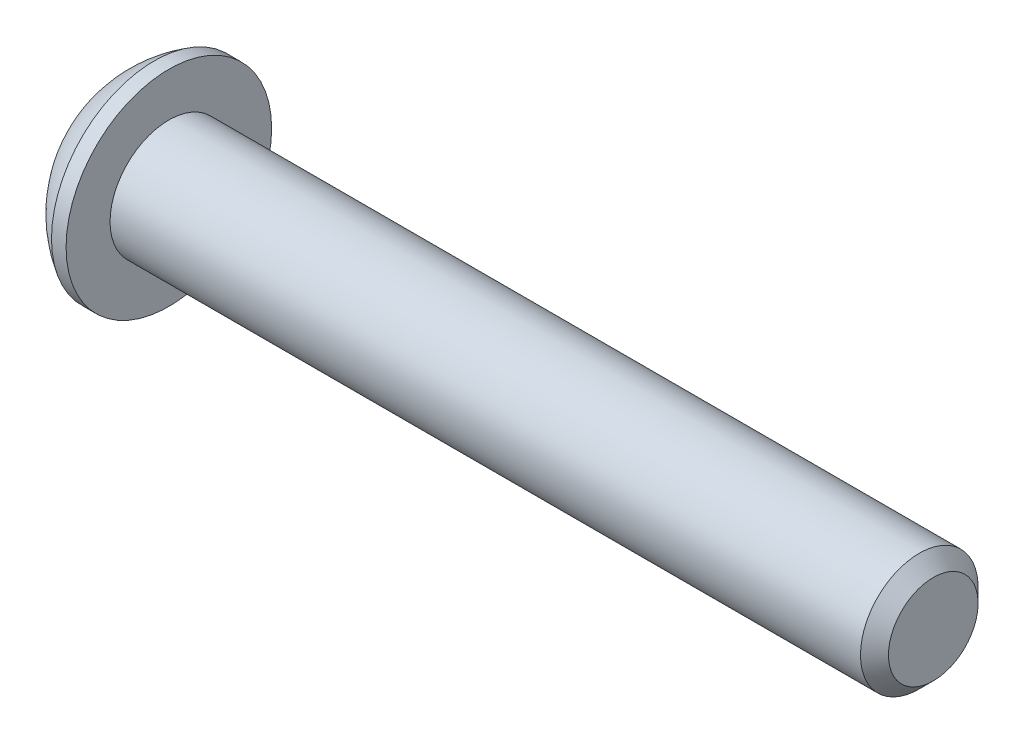
ISO-10303-21;
HEADER;
FILE_DESCRIPTION(('STEP AP214'),'2;1');
FILE_NAME('part.step','',(''),(''),'','','');
FILE_SCHEMA(('AUTOMOTIVE_DESIGN { 1 0 10303 214 1 1 1 1 }'));
ENDSEC;
DATA;
#1=APPLICATION_CONTEXT('core data for automotive mechanical design processes');
#2=APPLICATION_PROTOCOL_DEFINITION('international standard','automotive_design',2000,#1);
#3=PRODUCT_CONTEXT('',#1,'mechanical');
#4=PRODUCT('Part','Part','',(#3));
#5=PRODUCT_RELATED_PRODUCT_CATEGORY('part','',(#4));
#6=PRODUCT_DEFINITION_FORMATION('','',#4);
#7=PRODUCT_DEFINITION_CONTEXT('part definition',#1,'design');
#8=PRODUCT_DEFINITION('design','',#6,#7);
#9=PRODUCT_DEFINITION_SHAPE('','',#8);
#10=(LENGTH_UNIT() NAMED_UNIT(*) SI_UNIT(.MILLI.,.METRE.));
#11=(NAMED_UNIT(*) PLANE_ANGLE_UNIT() SI_UNIT($,.RADIAN.));
#12=(NAMED_UNIT(*) SI_UNIT($,.STERADIAN.) SOLID_ANGLE_UNIT());
#13=UNCERTAINTY_MEASURE_WITH_UNIT(LENGTH_MEASURE(1.E-05),#10,'distance_accuracy_value','');
#14=(GEOMETRIC_REPRESENTATION_CONTEXT(3) GLOBAL_UNCERTAINTY_ASSIGNED_CONTEXT((#13)) GLOBAL_UNIT_ASSIGNED_CONTEXT((#10,
#11,#12)) REPRESENTATION_CONTEXT('',''));
#15=CARTESIAN_POINT('',(0.,0.,0.));
#16=DIRECTION('',(0.,0.,1.));
#17=DIRECTION('',(1.,0.,0.));
#18=AXIS2_PLACEMENT_3D('',#15,#16,#17);
#19=CARTESIAN_POINT('',(0.,0.,0.));
#20=DIRECTION('',(-1.,0.,0.));
#21=DIRECTION('',(0.,0.,1.));
#22=AXIS2_PLACEMENT_3D('',#19,#20,#21);
#23=PLANE('',#22);
#24=CARTESIAN_POINT('',(0.,0.,0.));
#25=DIRECTION('',(-1.,0.,0.));
#26=DIRECTION('',(0.,0.,1.));
#27=AXIS2_PLACEMENT_3D('',#24,#25,#26);
#28=CIRCLE('',#27,2.77495);
#29=CARTESIAN_POINT('',(0.,0.,2.77495));
#30=VERTEX_POINT('',#29);
#31=EDGE_CURVE('E11',#30,#30,#28,.T.);
#32=ORIENTED_EDGE('',*,*,#31,.T.);
#33=EDGE_LOOP('',(#32));
#34=FACE_BOUND('',#33,.T.);
#35=DIRECTION('',(0.,-1.,0.));
#36=VECTOR('',#35,1.);
#37=CARTESIAN_POINT('',(0.,-1.14384635331849,1.9812));
#38=LINE('',#37,#36);
#39=CARTESIAN_POINT('',(0.,1.14384635331849,1.9812));
#40=VERTEX_POINT('',#39);
#41=CARTESIAN_POINT('',(0.,-1.14384635331849,1.9812));
#42=VERTEX_POINT('',#41);
#43=EDGE_CURVE('E48',#40,#42,#38,.T.);
#44=ORIENTED_EDGE('',*,*,#43,.T.);
#45=DIRECTION('',(0.,-0.5,-0.866025403784439));
#46=VECTOR('',#45,1.);
#47=CARTESIAN_POINT('',(0.,-2.28769270663697,0.));
#48=LINE('',#47,#46);
#49=CARTESIAN_POINT('',(0.,-2.28769270663697,0.));
#50=VERTEX_POINT('',#49);
#51=EDGE_CURVE('E369',#42,#50,#48,.T.);
#52=ORIENTED_EDGE('',*,*,#51,.T.);
#53=DIRECTION('',(0.,0.5,-0.866025403784439));
#54=VECTOR('',#53,1.);
#55=CARTESIAN_POINT('',(0.,-1.14384635331849,-1.9812));
#56=LINE('',#55,#54);
#57=CARTESIAN_POINT('',(0.,-1.14384635331849,-1.9812));
#58=VERTEX_POINT('',#57);
#59=EDGE_CURVE('E133',#50,#58,#56,.T.);
#60=ORIENTED_EDGE('',*,*,#59,.T.);
#61=DIRECTION('',(0.,1.,0.));
#62=VECTOR('',#61,1.);
#63=CARTESIAN_POINT('',(0.,1.14384635331849,-1.9812));
#64=LINE('',#63,#62);
#65=CARTESIAN_POINT('',(0.,1.14384635331849,-1.9812));
#66=VERTEX_POINT('',#65);
#67=EDGE_CURVE('E372',#58,#66,#64,.T.);
#68=ORIENTED_EDGE('',*,*,#67,.T.);
#69=DIRECTION('',(0.,0.5,0.866025403784438));
#70=VECTOR('',#69,1.);
#71=CARTESIAN_POINT('',(0.,2.28769270663697,0.));
#72=LINE('',#71,#70);
#73=CARTESIAN_POINT('',(0.,2.28769270663697,0.));
#74=VERTEX_POINT('',#73);
#75=EDGE_CURVE('E374',#66,#74,#72,.T.);
#76=ORIENTED_EDGE('',*,*,#75,.T.);
#77=DIRECTION('',(0.,-0.5,0.866025403784438));
#78=VECTOR('',#77,1.);
#79=CARTESIAN_POINT('',(0.,1.14384635331849,1.9812));
#80=LINE('',#79,#78);
#81=EDGE_CURVE('E376',#74,#40,#80,.T.);
#82=ORIENTED_EDGE('',*,*,#81,.T.);
#83=EDGE_LOOP('',(#44,#52,#60,#68,#76,#82));
#84=FACE_BOUND('',#83,.T.);
#85=ADVANCED_FACE('F34',(#34,#84),#23,.T.);
#86=CARTESIAN_POINT('',(5.78512506188119,0.,0.));
#87=DIRECTION('',(-1.,0.,0.));
#88=DIRECTION('',(0.,1.,0.));
#89=AXIS2_PLACEMENT_3D('',#86,#87,#88);
#90=SPHERICAL_SURFACE('',#89,6.41623094067739);
#91=CARTESIAN_POINT('',(2.5654,0.,0.));
#92=DIRECTION('',(-1.,0.,0.));
#93=DIRECTION('',(0.,0.,1.));
#94=AXIS2_PLACEMENT_3D('',#91,#92,#93);
#95=CIRCLE('',#94,5.5499);
#96=CARTESIAN_POINT('',(2.5654,0.,5.5499));
#97=VERTEX_POINT('',#96);
#98=EDGE_CURVE('E41',#97,#97,#95,.T.);
#99=ORIENTED_EDGE('',*,*,#98,.T.);
#100=EDGE_LOOP('',(#99));
#101=FACE_BOUND('',#100,.T.);
#102=ORIENTED_EDGE('',*,*,#31,.F.);
#103=EDGE_LOOP('',(#102));
#104=FACE_BOUND('',#103,.T.);
#105=ADVANCED_FACE('F160',(#101,#104),#90,.T.);
#106=CARTESIAN_POINT('',(0.,0.,0.));
#107=DIRECTION('',(-1.,0.,0.));
#108=DIRECTION('',(0.,0.,1.));
#109=AXIS2_PLACEMENT_3D('',#106,#107,#108);
#110=CYLINDRICAL_SURFACE('',#109,5.5499);
#111=ORIENTED_EDGE('',*,*,#98,.F.);
#112=EDGE_LOOP('',(#111));
#113=FACE_BOUND('',#112,.T.);
#114=CARTESIAN_POINT('',(3.3528,0.,0.));
#115=DIRECTION('',(-1.,0.,0.));
#116=DIRECTION('',(0.,0.,1.));
#117=AXIS2_PLACEMENT_3D('',#114,#115,#116);
#118=CIRCLE('',#117,5.5499);
#119=CARTESIAN_POINT('',(3.3528,0.,5.5499));
#120=VERTEX_POINT('',#119);
#121=EDGE_CURVE('E155',#120,#120,#118,.T.);
#122=ORIENTED_EDGE('',*,*,#121,.T.);
#123=EDGE_LOOP('',(#122));
#124=FACE_BOUND('',#123,.T.);
#125=ADVANCED_FACE('F163',(#113,#124),#110,.T.);
#126=CARTESIAN_POINT('',(3.3528,3.175,0.));
#127=DIRECTION('',(-1.,0.,0.));
#128=DIRECTION('',(0.,0.,1.));
#129=AXIS2_PLACEMENT_3D('',#126,#127,#128);
#130=PLANE('',#129);
#131=ORIENTED_EDGE('',*,*,#121,.F.);
#132=EDGE_LOOP('',(#131));
#133=FACE_BOUND('',#132,.T.);
#134=CARTESIAN_POINT('',(3.3528,0.,0.));
#135=DIRECTION('',(-1.,0.,0.));
#136=DIRECTION('',(0.,0.,1.));
#137=AXIS2_PLACEMENT_3D('',#134,#135,#136);
#138=CIRCLE('',#137,3.175);
#139=CARTESIAN_POINT('',(3.3528,0.,3.175));
#140=VERTEX_POINT('',#139);
#141=EDGE_CURVE('E152',#140,#140,#138,.T.);
#142=ORIENTED_EDGE('',*,*,#141,.T.);
#143=EDGE_LOOP('',(#142));
#144=FACE_BOUND('',#143,.T.);
#145=ADVANCED_FACE('F166',(#133,#144),#130,.F.);
#146=CARTESIAN_POINT('',(0.,0.,0.));
#147=DIRECTION('',(-1.,0.,0.));
#148=DIRECTION('',(0.,0.,1.));
#149=AXIS2_PLACEMENT_3D('',#146,#147,#148);
#150=CYLINDRICAL_SURFACE('',#149,3.175);
#151=ORIENTED_EDGE('',*,*,#141,.F.);
#152=EDGE_LOOP('',(#151));
#153=FACE_BOUND('',#152,.T.);
#154=CARTESIAN_POINT('',(43.87215,0.,0.));
#155=DIRECTION('',(-1.,0.,0.));
#156=DIRECTION('',(0.,0.,1.));
#157=AXIS2_PLACEMENT_3D('',#154,#155,#156);
#158=CIRCLE('',#157,3.17500000000001);
#159=CARTESIAN_POINT('',(43.87215,0.,3.17500000000001));
#160=VERTEX_POINT('',#159);
#161=EDGE_CURVE('E149',#160,#160,#158,.T.);
#162=ORIENTED_EDGE('',*,*,#161,.T.);
#163=EDGE_LOOP('',(#162));
#164=FACE_BOUND('',#163,.T.);
#165=ADVANCED_FACE('F172',(#153,#164),#150,.T.);
#166=CARTESIAN_POINT('',(44.6278,0.,0.));
#167=DIRECTION('',(-1.,0.,0.));
#168=DIRECTION('',(0.,0.,1.));
#169=AXIS2_PLACEMENT_3D('',#166,#167,#168);
#170=CONICAL_SURFACE('',#169,2.41935,0.785398163397433);
#171=ORIENTED_EDGE('',*,*,#161,.F.);
#172=EDGE_LOOP('',(#171));
#173=FACE_BOUND('',#172,.T.);
#174=CARTESIAN_POINT('',(44.6278,0.,0.));
#175=DIRECTION('',(-1.,0.,0.));
#176=DIRECTION('',(0.,0.,1.));
#177=AXIS2_PLACEMENT_3D('',#174,#175,#176);
#178=CIRCLE('',#177,2.41935);
#179=CARTESIAN_POINT('',(44.6278,0.,2.41935));
#180=VERTEX_POINT('',#179);
#181=EDGE_CURVE('E145',#180,#180,#178,.T.);
#182=ORIENTED_EDGE('',*,*,#181,.T.);
#183=EDGE_LOOP('',(#182));
#184=FACE_BOUND('',#183,.T.);
#185=ADVANCED_FACE('F178',(#173,#184),#170,.T.);
#186=CARTESIAN_POINT('',(44.6278,0.,0.));
#187=DIRECTION('',(-1.,0.,0.));
#188=DIRECTION('',(0.,0.,1.));
#189=AXIS2_PLACEMENT_3D('',#186,#187,#188);
#190=PLANE('',#189);
#191=ORIENTED_EDGE('',*,*,#181,.F.);
#192=EDGE_LOOP('',(#191));
#193=FACE_BOUND('',#192,.T.);
#194=ADVANCED_FACE('F184',(#193),#190,.F.);
#195=CARTESIAN_POINT('',(2.2098,-2.28769270663697,0.));
#196=DIRECTION('',(0.,0.866025403784439,-0.5));
#197=DIRECTION('',(0.,0.5,0.866025403784439));
#198=AXIS2_PLACEMENT_3D('',#195,#196,#197);
#199=PLANE('',#198);
#200=DIRECTION('',(0.,-0.5,-0.866025403784439));
#201=VECTOR('',#200,1.);
#202=CARTESIAN_POINT('',(2.2098,-2.28769270663697,0.));
#203=LINE('',#202,#201);
#204=CARTESIAN_POINT('',(2.2098,-1.14384635331849,1.9812));
#205=VERTEX_POINT('',#204);
#206=CARTESIAN_POINT('',(2.2098,-1.71576952997773,0.9906));
#207=VERTEX_POINT('',#206);
#208=EDGE_CURVE('E116',#205,#207,#203,.T.);
#209=ORIENTED_EDGE('',*,*,#208,.T.);
#210=CARTESIAN_POINT('',(2.2098,-2.28769270663697,0.));
#211=VERTEX_POINT('',#210);
#212=EDGE_CURVE('E109',#207,#211,#203,.T.);
#213=ORIENTED_EDGE('',*,*,#212,.T.);
#214=DIRECTION('',(-1.,0.,0.));
#215=VECTOR('',#214,1.);
#216=CARTESIAN_POINT('',(2.2098,-2.28769270663697,0.));
#217=LINE('',#216,#215);
#218=EDGE_CURVE('E113',#211,#50,#217,.T.);
#219=ORIENTED_EDGE('',*,*,#218,.T.);
#220=ORIENTED_EDGE('',*,*,#51,.F.);
#221=DIRECTION('',(-1.,0.,0.));
#222=VECTOR('',#221,1.);
#223=CARTESIAN_POINT('',(2.2098,-1.14384635331849,1.9812));
#224=LINE('',#223,#222);
#225=EDGE_CURVE('E368',#205,#42,#224,.T.);
#226=ORIENTED_EDGE('',*,*,#225,.F.);
#227=EDGE_LOOP('',(#209,#213,#219,#220,#226));
#228=FACE_BOUND('',#227,.T.);
#229=ADVANCED_FACE('F111',(#228),#199,.T.);
#230=CARTESIAN_POINT('',(2.2098,-1.14384635331849,-1.9812));
#231=DIRECTION('',(0.,0.866025403784439,0.5));
#232=DIRECTION('',(0.,-0.5,0.866025403784439));
#233=AXIS2_PLACEMENT_3D('',#230,#231,#232);
#234=PLANE('',#233);
#235=DIRECTION('',(0.,0.5,-0.866025403784439));
#236=VECTOR('',#235,1.);
#237=CARTESIAN_POINT('',(2.2098,-1.14384635331849,-1.9812));
#238=LINE('',#237,#236);
#239=CARTESIAN_POINT('',(2.2098,-1.71576952997773,-0.9906));
#240=VERTEX_POINT('',#239);
#241=EDGE_CURVE('E121',#211,#240,#238,.T.);
#242=ORIENTED_EDGE('',*,*,#241,.T.);
#243=CARTESIAN_POINT('',(2.2098,-1.14384635331849,-1.9812));
#244=VERTEX_POINT('',#243);
#245=EDGE_CURVE('E128',#240,#244,#238,.T.);
#246=ORIENTED_EDGE('',*,*,#245,.T.);
#247=DIRECTION('',(-1.,0.,0.));
#248=VECTOR('',#247,1.);
#249=CARTESIAN_POINT('',(2.2098,-1.14384635331849,-1.9812));
#250=LINE('',#249,#248);
#251=EDGE_CURVE('E135',#244,#58,#250,.T.);
#252=ORIENTED_EDGE('',*,*,#251,.T.);
#253=ORIENTED_EDGE('',*,*,#59,.F.);
#254=ORIENTED_EDGE('',*,*,#218,.F.);
#255=EDGE_LOOP('',(#242,#246,#252,#253,#254));
#256=FACE_BOUND('',#255,.T.);
#257=ADVANCED_FACE('F131',(#256),#234,.T.);
#258=CARTESIAN_POINT('',(2.2098,1.14384635331849,-1.9812));
#259=DIRECTION('',(0.,0.,1.));
#260=DIRECTION('',(1.,0.,0.));
#261=AXIS2_PLACEMENT_3D('',#258,#259,#260);
#262=PLANE('',#261);
#263=DIRECTION('',(0.,1.,0.));
#264=VECTOR('',#263,1.);
#265=CARTESIAN_POINT('',(2.2098,1.14384635331849,-1.9812));
#266=LINE('',#265,#264);
#267=CARTESIAN_POINT('',(2.2098,0.,-1.9812));
#268=VERTEX_POINT('',#267);
#269=EDGE_CURVE('E393',#244,#268,#266,.T.);
#270=ORIENTED_EDGE('',*,*,#269,.T.);
#271=CARTESIAN_POINT('',(2.2098,1.14384635331849,-1.9812));
#272=VERTEX_POINT('',#271);
#273=EDGE_CURVE('E127',#268,#272,#266,.T.);
#274=ORIENTED_EDGE('',*,*,#273,.T.);
#275=DIRECTION('',(-1.,0.,0.));
#276=VECTOR('',#275,1.);
#277=CARTESIAN_POINT('',(2.2098,1.14384635331849,-1.9812));
#278=LINE('',#277,#276);
#279=EDGE_CURVE('E140',#272,#66,#278,.T.);
#280=ORIENTED_EDGE('',*,*,#279,.T.);
#281=ORIENTED_EDGE('',*,*,#67,.F.);
#282=ORIENTED_EDGE('',*,*,#251,.F.);
#283=EDGE_LOOP('',(#270,#274,#280,#281,#282));
#284=FACE_BOUND('',#283,.T.);
#285=ADVANCED_FACE('F243',(#284),#262,.T.);
#286=CARTESIAN_POINT('',(2.2098,2.28769270663697,0.));
#287=DIRECTION('',(0.,-0.866025403784438,0.5));
#288=DIRECTION('',(0.,-0.5,-0.866025403784439));
#289=AXIS2_PLACEMENT_3D('',#286,#287,#288);
#290=PLANE('',#289);
#291=DIRECTION('',(0.,0.5,0.866025403784438));
#292=VECTOR('',#291,1.);
#293=CARTESIAN_POINT('',(2.2098,2.28769270663697,0.));
#294=LINE('',#293,#292);
#295=CARTESIAN_POINT('',(2.2098,1.71576952997773,-0.990600000000001));
#296=VERTEX_POINT('',#295);
#297=EDGE_CURVE('E355',#272,#296,#294,.T.);
#298=ORIENTED_EDGE('',*,*,#297,.T.);
#299=CARTESIAN_POINT('',(2.2098,2.28769270663697,0.));
#300=VERTEX_POINT('',#299);
#301=EDGE_CURVE('E395',#296,#300,#294,.T.);
#302=ORIENTED_EDGE('',*,*,#301,.T.);
#303=DIRECTION('',(-1.,0.,0.));
#304=VECTOR('',#303,1.);
#305=CARTESIAN_POINT('',(2.2098,2.28769270663697,0.));
#306=LINE('',#305,#304);
#307=EDGE_CURVE('E361',#300,#74,#306,.T.);
#308=ORIENTED_EDGE('',*,*,#307,.T.);
#309=ORIENTED_EDGE('',*,*,#75,.F.);
#310=ORIENTED_EDGE('',*,*,#279,.F.);
#311=EDGE_LOOP('',(#298,#302,#308,#309,#310));
#312=FACE_BOUND('',#311,.T.);
#313=ADVANCED_FACE('F252',(#312),#290,.T.);
#314=CARTESIAN_POINT('',(2.2098,1.14384635331849,1.9812));
#315=DIRECTION('',(0.,-0.866025403784438,-0.5));
#316=DIRECTION('',(0.,0.5,-0.866025403784439));
#317=AXIS2_PLACEMENT_3D('',#314,#315,#316);
#318=PLANE('',#317);
#319=DIRECTION('',(0.,-0.5,0.866025403784438));
#320=VECTOR('',#319,1.);
#321=CARTESIAN_POINT('',(2.2098,1.14384635331849,1.9812));
#322=LINE('',#321,#320);
#323=CARTESIAN_POINT('',(2.2098,1.71576952997773,0.990600000000001));
#324=VERTEX_POINT('',#323);
#325=EDGE_CURVE('E354',#300,#324,#322,.T.);
#326=ORIENTED_EDGE('',*,*,#325,.T.);
#327=CARTESIAN_POINT('',(2.2098,1.14384635331849,1.9812));
#328=VERTEX_POINT('',#327);
#329=EDGE_CURVE('E351',#324,#328,#322,.T.);
#330=ORIENTED_EDGE('',*,*,#329,.T.);
#331=DIRECTION('',(-1.,0.,0.));
#332=VECTOR('',#331,1.);
#333=CARTESIAN_POINT('',(2.2098,1.14384635331849,1.9812));
#334=LINE('',#333,#332);
#335=EDGE_CURVE('E381',#328,#40,#334,.T.);
#336=ORIENTED_EDGE('',*,*,#335,.T.);
#337=ORIENTED_EDGE('',*,*,#81,.F.);
#338=ORIENTED_EDGE('',*,*,#307,.F.);
#339=EDGE_LOOP('',(#326,#330,#336,#337,#338));
#340=FACE_BOUND('',#339,.T.);
#341=ADVANCED_FACE('F262',(#340),#318,.T.);
#342=CARTESIAN_POINT('',(2.2098,-1.14384635331849,1.9812));
#343=DIRECTION('',(0.,0.,-1.));
#344=DIRECTION('',(-1.,0.,0.));
#345=AXIS2_PLACEMENT_3D('',#342,#343,#344);
#346=PLANE('',#345);
#347=DIRECTION('',(0.,-1.,0.));
#348=VECTOR('',#347,1.);
#349=CARTESIAN_POINT('',(2.2098,-1.14384635331849,1.9812));
#350=LINE('',#349,#348);
#351=CARTESIAN_POINT('',(2.2098,0.,1.9812));
#352=VERTEX_POINT('',#351);
#353=EDGE_CURVE('E56',#328,#352,#350,.T.);
#354=ORIENTED_EDGE('',*,*,#353,.T.);
#355=EDGE_CURVE('E363',#352,#205,#350,.T.);
#356=ORIENTED_EDGE('',*,*,#355,.T.);
#357=ORIENTED_EDGE('',*,*,#225,.T.);
#358=ORIENTED_EDGE('',*,*,#43,.F.);
#359=ORIENTED_EDGE('',*,*,#335,.F.);
#360=EDGE_LOOP('',(#354,#356,#357,#358,#359));
#361=FACE_BOUND('',#360,.T.);
#362=ADVANCED_FACE('F272',(#361),#346,.T.);
#363=CARTESIAN_POINT('',(2.2098,0.,3.9624));
#364=DIRECTION('',(-1.,0.,0.));
#365=DIRECTION('',(0.,0.,1.));
#366=AXIS2_PLACEMENT_3D('',#363,#364,#365);
#367=PLANE('',#366);
#368=ORIENTED_EDGE('',*,*,#353,.F.);
#369=ORIENTED_EDGE('',*,*,#329,.F.);
#370=CARTESIAN_POINT('',(2.2098,0.,0.));
#371=DIRECTION('',(-1.,0.,0.));
#372=DIRECTION('',(0.,0.,1.));
#373=AXIS2_PLACEMENT_3D('',#370,#371,#372);
#374=CIRCLE('',#373,1.9812);
#375=EDGE_CURVE('E139',#352,#324,#374,.T.);
#376=ORIENTED_EDGE('',*,*,#375,.F.);
#377=EDGE_LOOP('',(#368,#369,#376));
#378=FACE_BOUND('',#377,.T.);
#379=ADVANCED_FACE('F282',(#378),#367,.T.);
#380=ORIENTED_EDGE('',*,*,#325,.F.);
#381=ORIENTED_EDGE('',*,*,#301,.F.);
#382=EDGE_CURVE('E146',#324,#296,#374,.T.);
#383=ORIENTED_EDGE('',*,*,#382,.F.);
#384=EDGE_LOOP('',(#380,#381,#383));
#385=FACE_BOUND('',#384,.T.);
#386=ADVANCED_FACE('F291',(#385),#367,.T.);
#387=ORIENTED_EDGE('',*,*,#297,.F.);
#388=ORIENTED_EDGE('',*,*,#273,.F.);
#389=EDGE_CURVE('E396',#296,#268,#374,.T.);
#390=ORIENTED_EDGE('',*,*,#389,.F.);
#391=EDGE_LOOP('',(#387,#388,#390));
#392=FACE_BOUND('',#391,.T.);
#393=ADVANCED_FACE('F302',(#392),#367,.T.);
#394=ORIENTED_EDGE('',*,*,#269,.F.);
#395=ORIENTED_EDGE('',*,*,#245,.F.);
#396=EDGE_CURVE('E394',#268,#240,#374,.T.);
#397=ORIENTED_EDGE('',*,*,#396,.F.);
#398=EDGE_LOOP('',(#394,#395,#397));
#399=FACE_BOUND('',#398,.T.);
#400=ADVANCED_FACE('F311',(#399),#367,.T.);
#401=ORIENTED_EDGE('',*,*,#241,.F.);
#402=ORIENTED_EDGE('',*,*,#212,.F.);
#403=EDGE_CURVE('E123',#240,#207,#374,.T.);
#404=ORIENTED_EDGE('',*,*,#403,.F.);
#405=EDGE_LOOP('',(#401,#402,#404));
#406=FACE_BOUND('',#405,.T.);
#407=ADVANCED_FACE('F122',(#406),#367,.T.);
#408=ORIENTED_EDGE('',*,*,#208,.F.);
#409=ORIENTED_EDGE('',*,*,#355,.F.);
#410=EDGE_CURVE('E134',#207,#352,#374,.T.);
#411=ORIENTED_EDGE('',*,*,#410,.F.);
#412=EDGE_LOOP('',(#408,#409,#411));
#413=FACE_BOUND('',#412,.T.);
#414=ADVANCED_FACE('F294',(#413),#367,.T.);
#415=CARTESIAN_POINT('',(3.3536463533185,0.,0.));
#416=DIRECTION('',(-1.,0.,0.));
#417=DIRECTION('',(0.,0.,1.));
#418=AXIS2_PLACEMENT_3D('',#415,#416,#417);
#419=CONICAL_SURFACE('',#418,0.,1.04719755119659);
#420=ORIENTED_EDGE('',*,*,#375,.T.);
#421=ORIENTED_EDGE('',*,*,#382,.T.);
#422=ORIENTED_EDGE('',*,*,#389,.T.);
#423=ORIENTED_EDGE('',*,*,#396,.T.);
#424=ORIENTED_EDGE('',*,*,#403,.T.);
#425=ORIENTED_EDGE('',*,*,#410,.T.);
#426=EDGE_LOOP('',(#420,#421,#422,#423,#424,#425));
#427=FACE_BOUND('',#426,.T.);
#428=CARTESIAN_POINT('',(3.3536463533185,0.,0.));
#429=VERTEX_POINT('',#428);
#430=VERTEX_LOOP('',#429);
#431=FACE_BOUND('',#430,.T.);
#432=ADVANCED_FACE('F335',(#427,#431),#419,.F.);
#433=CLOSED_SHELL('',(#85,#105,#125,#145,#165,#185,#194,#229,#257,#285,#313,#341,#362,#379,#386,
#393,#400,#407,#414,#432));
#434=MANIFOLD_SOLID_BREP('B2',#433);
#435=ADVANCED_BREP_SHAPE_REPRESENTATION('',(#18,#434),#14);
#436=SHAPE_DEFINITION_REPRESENTATION(#9,#435);
ENDSEC;
END-ISO-10303-21;
